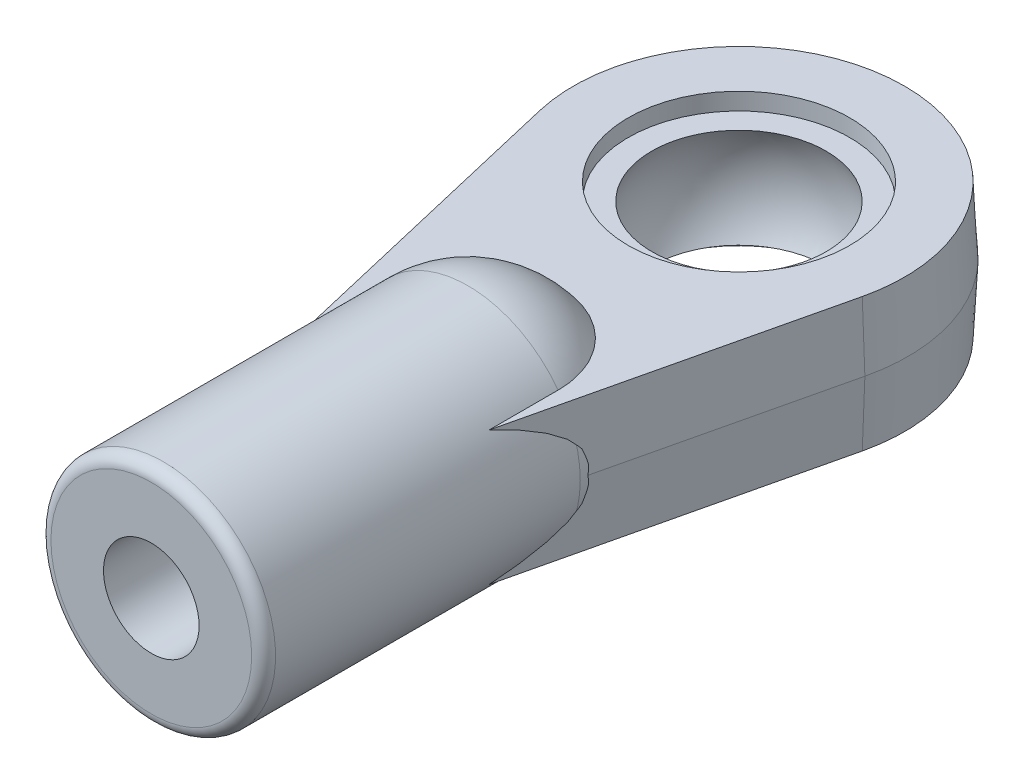
ISO-10303-21;
HEADER;
FILE_DESCRIPTION(('STEP AP214'),'2;1');
FILE_NAME('part.step','',(''),(''),'','','');
FILE_SCHEMA(('AUTOMOTIVE_DESIGN { 1 0 10303 214 1 1 1 1 }'));
ENDSEC;
DATA;
#1=APPLICATION_CONTEXT('core data for automotive mechanical design processes');
#2=APPLICATION_PROTOCOL_DEFINITION('international standard','automotive_design',2000,#1);
#3=PRODUCT_CONTEXT('',#1,'mechanical');
#4=PRODUCT('Part','Part','',(#3));
#5=PRODUCT_RELATED_PRODUCT_CATEGORY('part','',(#4));
#6=PRODUCT_DEFINITION_FORMATION('','',#4);
#7=PRODUCT_DEFINITION_CONTEXT('part definition',#1,'design');
#8=PRODUCT_DEFINITION('design','',#6,#7);
#9=PRODUCT_DEFINITION_SHAPE('','',#8);
#10=(LENGTH_UNIT() NAMED_UNIT(*) SI_UNIT(.MILLI.,.METRE.));
#11=(NAMED_UNIT(*) PLANE_ANGLE_UNIT() SI_UNIT($,.RADIAN.));
#12=(NAMED_UNIT(*) SI_UNIT($,.STERADIAN.) SOLID_ANGLE_UNIT());
#13=UNCERTAINTY_MEASURE_WITH_UNIT(LENGTH_MEASURE(1.E-05),#10,'distance_accuracy_value','');
#14=(GEOMETRIC_REPRESENTATION_CONTEXT(3) GLOBAL_UNCERTAINTY_ASSIGNED_CONTEXT((#13)) GLOBAL_UNIT_ASSIGNED_CONTEXT((#10,
#11,#12)) REPRESENTATION_CONTEXT('',''));
#15=CARTESIAN_POINT('',(0.,0.,0.));
#16=DIRECTION('',(0.,0.,1.));
#17=DIRECTION('',(1.,0.,0.));
#18=AXIS2_PLACEMENT_3D('',#15,#16,#17);
#19=CARTESIAN_POINT('',(0.,1.5875,-18.73885));
#20=DIRECTION('',(0.,1.,0.));
#21=DIRECTION('',(0.,0.,1.));
#22=AXIS2_PLACEMENT_3D('',#19,#20,#21);
#23=PLANE('',#22);
#24=CARTESIAN_POINT('',(0.,1.5875,-18.73885));
#25=DIRECTION('',(0.,1.,0.));
#26=DIRECTION('',(0.,0.,1.));
#27=AXIS2_PLACEMENT_3D('',#24,#25,#26);
#28=CIRCLE('',#27,3.5306);
#29=CARTESIAN_POINT('',(0.,1.5875,-15.20825));
#30=VERTEX_POINT('',#29);
#31=EDGE_CURVE('P0_E20',#30,#30,#28,.T.);
#32=ORIENTED_EDGE('',*,*,#31,.T.);
#33=EDGE_LOOP('',(#32));
#34=FACE_BOUND('',#33,.T.);
#35=CARTESIAN_POINT('',(0.,1.5875,-21.5177713572895));
#36=CARTESIAN_POINT('',(0.0780233970109175,1.5875,-21.5177708897208));
#37=CARTESIAN_POINT('',(0.156061132928654,1.5875,-21.5144824409786));
#38=CARTESIAN_POINT('',(0.311597316268005,1.5875,-21.5013500255618));
#39=CARTESIAN_POINT('',(0.38909559764727,1.5875,-21.4915041234929));
#40=CARTESIAN_POINT('',(0.543117688376616,1.5875,-21.4653010984848));
#41=CARTESIAN_POINT('',(0.61963975090967,1.5875,-21.4489336397251));
#42=CARTESIAN_POINT('',(0.771075578611785,1.5875,-21.4098003250142));
#43=CARTESIAN_POINT('',(0.845987985313132,1.5875,-21.3870292767222));
#44=CARTESIAN_POINT('',(1.06718751098859,1.5875,-21.3094255696959));
#45=CARTESIAN_POINT('',(1.21030919565112,1.5875,-21.2452386063567));
#46=CARTESIAN_POINT('',(1.48372914335094,1.5875,-21.093713605579));
#47=CARTESIAN_POINT('',(1.61402691865729,1.5875,-21.0063746880698));
#48=CARTESIAN_POINT('',(1.7970247350954,1.5875,-20.8599907156731));
#49=CARTESIAN_POINT('',(1.85598367192579,1.5875,-20.808594810804));
#50=CARTESIAN_POINT('',(1.96932163723164,1.5875,-20.7010594238807));
#51=CARTESIAN_POINT('',(2.02370502662113,1.5875,-20.6449245631263));
#52=CARTESIAN_POINT('',(2.12757332441993,1.5875,-20.5282461366586));
#53=CARTESIAN_POINT('',(2.17705600269889,1.5875,-20.4677005853578));
#54=CARTESIAN_POINT('',(2.27074994631359,1.5875,-20.3426616964005));
#55=CARTESIAN_POINT('',(2.31495998807603,1.5875,-20.2781674476397));
#56=CARTESIAN_POINT('',(2.43915822774601,1.5875,-20.0794648960385));
#57=CARTESIAN_POINT('',(2.51082410606128,1.5875,-19.9399134812632));
#58=CARTESIAN_POINT('',(2.62966634363635,1.5875,-19.6508349270353));
#59=CARTESIAN_POINT('',(2.67684296445287,1.5875,-19.5013078941462));
#60=CARTESIAN_POINT('',(2.74543580972441,1.5875,-19.1964365865845));
#61=CARTESIAN_POINT('',(2.76685189660724,1.5875,-19.0410922808496));
#62=CARTESIAN_POINT('',(2.78329356222039,1.5875,-18.7290133036645));
#63=CARTESIAN_POINT('',(2.77831914095071,1.5875,-18.5722786322141));
#64=CARTESIAN_POINT('',(2.74214097095968,1.5875,-18.2618875359936));
#65=CARTESIAN_POINT('',(2.71093736231285,1.5875,-18.108231094789));
#66=CARTESIAN_POINT('',(2.62312852141531,1.5875,-17.8082652710581));
#67=CARTESIAN_POINT('',(2.56652301785846,1.5875,-17.6619559670218));
#68=CARTESIAN_POINT('',(2.46389138915448,1.5875,-17.4513030402927));
#69=CARTESIAN_POINT('',(2.42670294999351,1.5875,-17.3825203687204));
#70=CARTESIAN_POINT('',(2.34666639430291,1.5875,-17.2483286082619));
#71=CARTESIAN_POINT('',(2.30381959030906,1.5875,-17.1829187418847));
#72=CARTESIAN_POINT('',(2.21278651269454,1.5875,-17.0559720709137));
#73=CARTESIAN_POINT('',(2.16460266549794,1.5875,-16.9944335260597));
#74=CARTESIAN_POINT('',(2.06319162073477,1.5875,-16.8755842356939));
#75=CARTESIAN_POINT('',(2.00995960080364,1.5875,-16.8182776276671));
#76=CARTESIAN_POINT('',(1.84335642684013,1.5875,-16.653475168277));
#77=CARTESIAN_POINT('',(1.72295727630919,1.58750000000001,-16.5529284561832));
#78=CARTESIAN_POINT('',(1.46697274328732,1.58749999999999,-16.3735121455689));
#79=CARTESIAN_POINT('',(1.33138793830244,1.58749999999997,-16.2946417230992));
#80=CARTESIAN_POINT('',(1.11956731470582,1.58749999999998,-16.1942246482444));
#81=CARTESIAN_POINT('',(1.04746232878977,1.5875,-16.163708090048));
#82=CARTESIAN_POINT('',(0.900976845737199,1.58750000000001,-16.1088789966126));
#83=CARTESIAN_POINT('',(0.826598245143451,1.5875,-16.0845614405207));
#84=CARTESIAN_POINT('',(0.676182140780832,1.5875,-16.0423192992328));
#85=CARTESIAN_POINT('',(0.60014746021542,1.5875,-16.0243846189846));
#86=CARTESIAN_POINT('',(0.446852225135867,1.5875,-15.9949816333477));
#87=CARTESIAN_POINT('',(0.369592039110233,1.5875,-15.9835114207263));
#88=CARTESIAN_POINT('',(0.243510088508142,1.5875,-15.9701885983606));
#89=CARTESIAN_POINT('',(0.194890190052977,1.5875,-15.9663423325502));
#90=CARTESIAN_POINT('',(0.0975153944611177,1.5875,-15.9612122086222));
#91=CARTESIAN_POINT('',(0.0487604973244243,1.5875,-15.9599283505047));
#92=CARTESIAN_POINT('',(-0.0780233970109172,1.5875,-15.9599291102792));
#93=CARTESIAN_POINT('',(-0.156061132928654,1.5875,-15.9632175590214));
#94=CARTESIAN_POINT('',(-0.311597316268005,1.5875,-15.9763499744382));
#95=CARTESIAN_POINT('',(-0.38909559764727,1.5875,-15.9861958765071));
#96=CARTESIAN_POINT('',(-0.543117688376615,1.5875,-16.0123989015152));
#97=CARTESIAN_POINT('',(-0.619639750909669,1.5875,-16.0287663602749));
#98=CARTESIAN_POINT('',(-0.771075578611784,1.5875,-16.0678996749858));
#99=CARTESIAN_POINT('',(-0.845987985313132,1.5875,-16.0906707232778));
#100=CARTESIAN_POINT('',(-1.06718751098859,1.5875,-16.1682744303041));
#101=CARTESIAN_POINT('',(-1.21030919565111,1.5875,-16.2324613936433));
#102=CARTESIAN_POINT('',(-1.48372914335094,1.5875,-16.383986394421));
#103=CARTESIAN_POINT('',(-1.61402691865729,1.5875,-16.4713253119302));
#104=CARTESIAN_POINT('',(-1.7970247350954,1.5875,-16.6177092843269));
#105=CARTESIAN_POINT('',(-1.85598367192579,1.5875,-16.669105189196));
#106=CARTESIAN_POINT('',(-1.96932163723163,1.5875,-16.7766405761193));
#107=CARTESIAN_POINT('',(-2.02370502662112,1.5875,-16.8327754368737));
#108=CARTESIAN_POINT('',(-2.12757332441993,1.5875,-16.9494538633414));
#109=CARTESIAN_POINT('',(-2.17705600269889,1.5875,-17.0099994146421));
#110=CARTESIAN_POINT('',(-2.27074994631359,1.5875,-17.1350383035995));
#111=CARTESIAN_POINT('',(-2.31495998807602,1.5875,-17.1995325523603));
#112=CARTESIAN_POINT('',(-2.43915822774601,1.5875,-17.3982351039615));
#113=CARTESIAN_POINT('',(-2.51082410606128,1.5875,-17.5377865187368));
#114=CARTESIAN_POINT('',(-2.62966634363635,1.5875,-17.8268650729647));
#115=CARTESIAN_POINT('',(-2.67684296445287,1.5875,-17.9763921058538));
#116=CARTESIAN_POINT('',(-2.74543580972441,1.5875,-18.2812634134155));
#117=CARTESIAN_POINT('',(-2.76685189660724,1.5875,-18.4366077191504));
#118=CARTESIAN_POINT('',(-2.78329356222039,1.5875,-18.7486866963355));
#119=CARTESIAN_POINT('',(-2.77831914095071,1.5875,-18.9054213677859));
#120=CARTESIAN_POINT('',(-2.74214097095968,1.5875,-19.2158124640064));
#121=CARTESIAN_POINT('',(-2.71093736231285,1.5875,-19.369468905211));
#122=CARTESIAN_POINT('',(-2.62312852141531,1.5875,-19.6694347289419));
#123=CARTESIAN_POINT('',(-2.56652301785846,1.5875,-19.8157440329782));
#124=CARTESIAN_POINT('',(-2.46389138915447,1.5875,-20.0263969597073));
#125=CARTESIAN_POINT('',(-2.42670294999351,1.5875,-20.0951796312795));
#126=CARTESIAN_POINT('',(-2.34666639430291,1.5875,-20.2293713917381));
#127=CARTESIAN_POINT('',(-2.30381959030906,1.5875,-20.2947812581153));
#128=CARTESIAN_POINT('',(-2.21278651269455,1.5875,-20.4217279290863));
#129=CARTESIAN_POINT('',(-2.16460266549794,1.5875,-20.4832664739403));
#130=CARTESIAN_POINT('',(-2.06319162073478,1.5875,-20.6021157643061));
#131=CARTESIAN_POINT('',(-2.00995960080364,1.5875,-20.6594223723328));
#132=CARTESIAN_POINT('',(-1.84335642684014,1.5875,-20.824224831723));
#133=CARTESIAN_POINT('',(-1.7229572763092,1.58750000000001,-20.9247715438168));
#134=CARTESIAN_POINT('',(-1.46697274328732,1.58749999999999,-21.1041878544311));
#135=CARTESIAN_POINT('',(-1.33138793830245,1.58749999999996,-21.1830582769008));
#136=CARTESIAN_POINT('',(-1.11956731470582,1.58749999999998,-21.2834753517556));
#137=CARTESIAN_POINT('',(-1.04746232878977,1.58749999999999,-21.313991909952));
#138=CARTESIAN_POINT('',(-0.900976845737205,1.58750000000001,-21.3688210033874));
#139=CARTESIAN_POINT('',(-0.826598245143456,1.5875,-21.3931385594793));
#140=CARTESIAN_POINT('',(-0.676182140780837,1.5875,-21.4353807007672));
#141=CARTESIAN_POINT('',(-0.600147460215425,1.5875,-21.4533153810154));
#142=CARTESIAN_POINT('',(-0.446852225135871,1.5875,-21.4827183666523));
#143=CARTESIAN_POINT('',(-0.369592039110237,1.5875,-21.4941885792737));
#144=CARTESIAN_POINT('',(-0.243510088508145,1.5875,-21.5075114016394));
#145=CARTESIAN_POINT('',(-0.194890190052979,1.5875,-21.5113576674498));
#146=CARTESIAN_POINT('',(-0.0975153944611187,1.5875,-21.5164877913778));
#147=CARTESIAN_POINT('',(-0.0487604973244245,1.5875,-21.5177716494953));
#148=CARTESIAN_POINT('',(0.,1.5875,-21.5177713572895));
#149=B_SPLINE_CURVE_WITH_KNOTS('',3,(#35,#36,#37,#38,#39,#40,#41,#42,#43,#44,#45,#46,#47,#48,
#49,#50,#51,#52,#53,#54,#55,#56,#57,#58,#59,#60,#61,#62,#63,#64,#65,#66,#67,#68,#69,#70,#71,#72,
#73,#74,#75,#76,#77,#78,#79,#80,#81,#82,#83,#84,#85,#86,#87,#88,#89,#90,#91,#92,#93,#94,#95,#96,
#97,#98,#99,#100,#101,#102,#103,#104,#105,#106,#107,#108,#109,#110,#111,#112,#113,#114,#115,
#116,#117,#118,#119,#120,#121,#122,#123,#124,#125,#126,#127,#128,#129,#130,#131,#132,#133,#134,
#135,#136,#137,#138,#139,#140,#141,#142,#143,#144,#145,#146,#147,#148),.UNSPECIFIED.,.T.,.F.,(4,
2,2,2,2,2,2,2,2,2,2,2,2,2,2,2,2,2,2,2,2,2,2,2,2,2,2,2,2,2,2,2,2,2,2,2,2,2,2,2,2,2,2,2,2,2,2,2,2,
2,2,2,2,2,2,2,4),(0.,0.234025302373472,0.46811970658274,0.702586605236248,0.93724417192487,
1.40544072040476,1.87365506889924,2.10806901100275,2.34225694275971,2.57655095968591,
2.81089924175706,3.27910719063613,3.74731013873254,4.21551558722033,4.68372103570813,
5.15192398380455,5.62013193268361,5.85448021475476,6.08877423168096,6.32296216343792,
6.55737610554143,7.02559045403588,7.49378700251573,7.72844456920437,7.9629114678579,
8.19700587206719,8.43103117444068,8.57728461337557,8.72353805231047,8.95756335468394,
9.19165775889321,9.42612465754672,9.66078222423534,10.1289787727152,10.5971931212097,
10.8316070633132,11.0657949950702,11.3000890119964,11.5344372940675,12.0026452429466,
12.470848191043,12.9390536395308,13.4072590880186,13.875462036115,14.3436699849941,
14.5780182670652,14.8123122839914,15.0465002157484,15.2809141578519,15.7491285063463,
16.2173250548262,16.4519826215148,16.6864495201684,16.9205439243777,17.1545692267511,
17.300822665686,17.4470761046209),.UNSPECIFIED.);
#150=CARTESIAN_POINT('',(0.,1.5875,-21.5177713572895));
#151=VERTEX_POINT('',#150);
#152=EDGE_CURVE('P0_E243',#151,#151,#149,.T.);
#153=ORIENTED_EDGE('',*,*,#152,.T.);
#154=EDGE_LOOP('',(#153));
#155=FACE_BOUND('',#154,.T.);
#156=ADVANCED_FACE('P0_F16',(#34,#155),#23,.T.);
#157=CARTESIAN_POINT('',(0.,1.5875,-18.73885));
#158=DIRECTION('',(0.,1.,0.));
#159=DIRECTION('',(0.,0.,1.));
#160=AXIS2_PLACEMENT_3D('',#157,#158,#159);
#161=CYLINDRICAL_SURFACE('',#160,3.5306);
#162=CARTESIAN_POINT('',(0.,2.1336,-18.73885));
#163=DIRECTION('',(0.,1.,0.));
#164=DIRECTION('',(0.,0.,1.));
#165=AXIS2_PLACEMENT_3D('',#162,#163,#164);
#166=CIRCLE('',#165,3.5306);
#167=CARTESIAN_POINT('',(0.,2.1336,-15.20825));
#168=VERTEX_POINT('',#167);
#169=EDGE_CURVE('P0_E238',#168,#168,#166,.F.);
#170=ORIENTED_EDGE('',*,*,#169,.F.);
#171=EDGE_LOOP('',(#170));
#172=FACE_BOUND('',#171,.T.);
#173=ORIENTED_EDGE('',*,*,#31,.F.);
#174=EDGE_LOOP('',(#173));
#175=FACE_BOUND('',#174,.T.);
#176=ADVANCED_FACE('P0_F76',(#172,#175),#161,.F.);
#177=CARTESIAN_POINT('',(0.,0.,-12.0142000001238));
#178=DIRECTION('',(0.,0.,1.));
#179=DIRECTION('',(1.,0.,0.));
#180=AXIS2_PLACEMENT_3D('',#177,#178,#179);
#181=CONICAL_SURFACE('',#180,1.52399999979025,1.02974425846679);
#182=CARTESIAN_POINT('',(-2.55795384873636E-10,0.,-12.9299115835408));
#183=VERTEX_POINT('',#182);
#184=VERTEX_LOOP('',#183);
#185=FACE_BOUND('',#184,.T.);
#186=CARTESIAN_POINT('',(0.,0.,-12.0142));
#187=DIRECTION('',(0.,0.,1.));
#188=DIRECTION('',(1.,0.,0.));
#189=AXIS2_PLACEMENT_3D('',#186,#187,#188);
#190=CIRCLE('',#189,1.524);
#191=CARTESIAN_POINT('',(1.524,0.,-12.0142));
#192=VERTEX_POINT('',#191);
#193=EDGE_CURVE('P0_E80',#192,#192,#190,.T.);
#194=ORIENTED_EDGE('',*,*,#193,.T.);
#195=EDGE_LOOP('',(#194));
#196=FACE_BOUND('',#195,.T.);
#197=ADVANCED_FACE('P0_F72',(#185,#196),#181,.F.);
#198=CARTESIAN_POINT('',(-2.62620354632618,0.,-6.35));
#199=DIRECTION('',(0.,0.0523359562429439,0.998629534754574));
#200=DIRECTION('',(0.,-0.998629534754574,0.0523359562429439));
#201=AXIS2_PLACEMENT_3D('',#198,#199,#200);
#202=PLANE('',#201);
#203=DIRECTION('',(1.,0.,0.));
#204=VECTOR('',#203,1.);
#205=CARTESIAN_POINT('',(0.,2.1336,-6.4618172378783));
#206=LINE('',#205,#204);
#207=CARTESIAN_POINT('',(-2.53762061529938,2.1336,-6.4618172378783));
#208=VERTEX_POINT('',#207);
#209=CARTESIAN_POINT('',(2.53762061529963,2.1336,-6.4618172378783));
#210=VERTEX_POINT('',#209);
#211=EDGE_CURVE('P0_E229',#208,#210,#206,.T.);
#212=ORIENTED_EDGE('',*,*,#211,.F.);
#213=DIRECTION('',(0.0414255695402248,0.997772303834552,-0.0522910306740929));
#214=VECTOR('',#213,1.);
#215=CARTESIAN_POINT('',(-2.62620354632618,0.,-6.35));
#216=LINE('',#215,#214);
#217=CARTESIAN_POINT('',(-2.62620354632618,0.,-6.35));
#218=VERTEX_POINT('',#217);
#219=EDGE_CURVE('P0_E88',#218,#208,#216,.T.);
#220=ORIENTED_EDGE('',*,*,#219,.F.);
#221=DIRECTION('',(1.,0.,0.));
#222=VECTOR('',#221,1.);
#223=CARTESIAN_POINT('',(-2.62620354632618,0.,-6.35));
#224=LINE('',#223,#222);
#225=CARTESIAN_POINT('',(-1.524,0.,-6.35));
#226=VERTEX_POINT('',#225);
#227=EDGE_CURVE('P0_E68',#218,#226,#224,.T.);
#228=ORIENTED_EDGE('',*,*,#227,.T.);
#229=CARTESIAN_POINT('',(0.,0.,-6.35));
#230=DIRECTION('',(0.,0.0523359562429439,0.998629534754574));
#231=DIRECTION('',(0.,-0.998629534754574,0.0523359562429439));
#232=AXIS2_PLACEMENT_3D('',#229,#230,#231);
#233=ELLIPSE('',#232,1.52609145530083,1.524);
#234=CARTESIAN_POINT('',(1.524,0.,-6.35));
#235=VERTEX_POINT('',#234);
#236=EDGE_CURVE('P0_E239',#226,#235,#233,.F.);
#237=ORIENTED_EDGE('',*,*,#236,.T.);
#238=DIRECTION('',(1.,0.,0.));
#239=VECTOR('',#238,1.);
#240=CARTESIAN_POINT('',(-2.62620354632618,0.,-6.35));
#241=LINE('',#240,#239);
#242=CARTESIAN_POINT('',(2.62620354632643,0.,-6.35));
#243=VERTEX_POINT('',#242);
#244=EDGE_CURVE('P0_E180',#235,#243,#241,.T.);
#245=ORIENTED_EDGE('',*,*,#244,.T.);
#246=DIRECTION('',(0.0414255695402248,-0.997772303834552,0.0522910306740929));
#247=VECTOR('',#246,1.);
#248=CARTESIAN_POINT('',(2.53762061529963,2.1336,-6.4618172378783));
#249=LINE('',#248,#247);
#250=EDGE_CURVE('P0_E86',#210,#243,#249,.T.);
#251=ORIENTED_EDGE('',*,*,#250,.F.);
#252=EDGE_LOOP('',(#212,#220,#228,#237,#245,#251));
#253=FACE_BOUND('',#252,.T.);
#254=ADVANCED_FACE('P0_F75',(#253),#202,.T.);
#255=CARTESIAN_POINT('',(0.,2.1336,-18.73885));
#256=DIRECTION('',(0.,1.,0.));
#257=DIRECTION('',(0.,0.,1.));
#258=AXIS2_PLACEMENT_3D('',#255,#256,#257);
#259=PLANE('',#258);
#260=ORIENTED_EDGE('',*,*,#211,.T.);
#261=DIRECTION('',(0.228803541615055,0.,-0.973472618692692));
#262=VECTOR('',#261,1.);
#263=CARTESIAN_POINT('',(5.13928588889286,2.13360000000001,-17.5309199666622));
#264=LINE('',#263,#262);
#265=CARTESIAN_POINT('',(5.139285888895,2.13360000001282,-17.5309199666613));
#266=VERTEX_POINT('',#265);
#267=EDGE_CURVE('P0_E82',#266,#210,#264,.F.);
#268=ORIENTED_EDGE('',*,*,#267,.F.);
#269=CARTESIAN_POINT('',(0.,2.1335999999792,-18.73885));
#270=DIRECTION('',(0.,-1.,0.));
#271=DIRECTION('',(0.,0.,-1.));
#272=AXIS2_PLACEMENT_3D('',#269,#270,#271);
#273=CIRCLE('',#272,5.27933276212576);
#274=CARTESIAN_POINT('',(-5.1392858888958,2.13360000001282,-17.5309199666612));
#275=VERTEX_POINT('',#274);
#276=EDGE_CURVE('P0_E113',#275,#266,#273,.T.);
#277=ORIENTED_EDGE('',*,*,#276,.F.);
#278=DIRECTION('',(0.228803541615055,0.,0.973472618692692));
#279=VECTOR('',#278,1.);
#280=CARTESIAN_POINT('',(-3.47254898062763,2.1336,-10.4395841800412));
#281=LINE('',#280,#279);
#282=EDGE_CURVE('P0_E83',#208,#275,#281,.F.);
#283=ORIENTED_EDGE('',*,*,#282,.F.);
#284=EDGE_LOOP('',(#260,#268,#277,#283));
#285=FACE_BOUND('',#284,.T.);
#286=ORIENTED_EDGE('',*,*,#169,.T.);
#287=EDGE_LOOP('',(#286));
#288=FACE_BOUND('',#287,.T.);
#289=ADVANCED_FACE('P0_F146',(#285,#288),#259,.T.);
#290=CARTESIAN_POINT('',(0.,0.,-18.73885));
#291=DIRECTION('',(-1.,0.,0.));
#292=DIRECTION('',(0.,0.,1.));
#293=AXIS2_PLACEMENT_3D('',#290,#291,#292);
#294=SPHERICAL_SURFACE('',#293,3.2004);
#295=CARTESIAN_POINT('',(3.2004,0.,-18.73885));
#296=VERTEX_POINT('',#295);
#297=VERTEX_LOOP('',#296);
#298=FACE_BOUND('',#297,.T.);
#299=CARTESIAN_POINT('',(-3.2004,0.,-18.73885));
#300=VERTEX_POINT('',#299);
#301=VERTEX_LOOP('',#300);
#302=FACE_BOUND('',#301,.T.);
#303=CARTESIAN_POINT('',(0.,-1.5875,-21.5177713572895));
#304=CARTESIAN_POINT('',(-0.0780233970109173,-1.5875,-21.5177708897208));
#305=CARTESIAN_POINT('',(-0.156061132928654,-1.5875,-21.5144824409786));
#306=CARTESIAN_POINT('',(-0.311597316268005,-1.5875,-21.5013500255618));
#307=CARTESIAN_POINT('',(-0.38909559764727,-1.5875,-21.4915041234929));
#308=CARTESIAN_POINT('',(-0.543117688376615,-1.5875,-21.4653010984848));
#309=CARTESIAN_POINT('',(-0.619639750909669,-1.5875,-21.4489336397251));
#310=CARTESIAN_POINT('',(-0.771075578611784,-1.5875,-21.4098003250142));
#311=CARTESIAN_POINT('',(-0.845987985313132,-1.5875,-21.3870292767222));
#312=CARTESIAN_POINT('',(-1.06718751098859,-1.5875,-21.3094255696959));
#313=CARTESIAN_POINT('',(-1.21030919565111,-1.5875,-21.2452386063567));
#314=CARTESIAN_POINT('',(-1.48372914335094,-1.5875,-21.093713605579));
#315=CARTESIAN_POINT('',(-1.61402691865729,-1.5875,-21.0063746880698));
#316=CARTESIAN_POINT('',(-1.7970247350954,-1.5875,-20.8599907156731));
#317=CARTESIAN_POINT('',(-1.85598367192579,-1.5875,-20.808594810804));
#318=CARTESIAN_POINT('',(-1.96932163723163,-1.5875,-20.7010594238807));
#319=CARTESIAN_POINT('',(-2.02370502662112,-1.5875,-20.6449245631263));
#320=CARTESIAN_POINT('',(-2.12757332441993,-1.5875,-20.5282461366586));
#321=CARTESIAN_POINT('',(-2.17705600269889,-1.5875,-20.4677005853578));
#322=CARTESIAN_POINT('',(-2.27074994631359,-1.5875,-20.3426616964005));
#323=CARTESIAN_POINT('',(-2.31495998807602,-1.5875,-20.2781674476397));
#324=CARTESIAN_POINT('',(-2.43915822774601,-1.5875,-20.0794648960385));
#325=CARTESIAN_POINT('',(-2.51082410606128,-1.5875,-19.9399134812632));
#326=CARTESIAN_POINT('',(-2.62966634363635,-1.5875,-19.6508349270353));
#327=CARTESIAN_POINT('',(-2.67684296445287,-1.5875,-19.5013078941462));
#328=CARTESIAN_POINT('',(-2.74543580972441,-1.5875,-19.1964365865845));
#329=CARTESIAN_POINT('',(-2.76685189660724,-1.5875,-19.0410922808496));
#330=CARTESIAN_POINT('',(-2.78329356222039,-1.5875,-18.7290133036644));
#331=CARTESIAN_POINT('',(-2.77831914095071,-1.5875,-18.5722786322141));
#332=CARTESIAN_POINT('',(-2.74214097095968,-1.5875,-18.2618875359936));
#333=CARTESIAN_POINT('',(-2.71093736231285,-1.5875,-18.108231094789));
#334=CARTESIAN_POINT('',(-2.62312852141531,-1.5875,-17.808265271058));
#335=CARTESIAN_POINT('',(-2.56652301785846,-1.5875,-17.6619559670218));
#336=CARTESIAN_POINT('',(-2.46389138915448,-1.5875,-17.4513030402927));
#337=CARTESIAN_POINT('',(-2.42670294999351,-1.5875,-17.3825203687204));
#338=CARTESIAN_POINT('',(-2.34666639430291,-1.5875,-17.2483286082619));
#339=CARTESIAN_POINT('',(-2.30381959030906,-1.5875,-17.1829187418847));
#340=CARTESIAN_POINT('',(-2.21278651269455,-1.5875,-17.0559720709137));
#341=CARTESIAN_POINT('',(-2.16460266549794,-1.5875,-16.9944335260597));
#342=CARTESIAN_POINT('',(-2.06319162073478,-1.5875,-16.8755842356939));
#343=CARTESIAN_POINT('',(-2.00995960080364,-1.5875,-16.8182776276671));
#344=CARTESIAN_POINT('',(-1.84335642684013,-1.5875,-16.653475168277));
#345=CARTESIAN_POINT('',(-1.7229572763092,-1.58750000000001,-16.5529284561832));
#346=CARTESIAN_POINT('',(-1.46697274328732,-1.58749999999999,-16.3735121455689));
#347=CARTESIAN_POINT('',(-1.33138793830244,-1.58749999999997,-16.2946417230992));
#348=CARTESIAN_POINT('',(-1.11956731470582,-1.58749999999998,-16.1942246482444));
#349=CARTESIAN_POINT('',(-1.04746232878977,-1.5875,-16.163708090048));
#350=CARTESIAN_POINT('',(-0.900976845737201,-1.58750000000001,-16.1088789966126));
#351=CARTESIAN_POINT('',(-0.826598245143452,-1.5875,-16.0845614405207));
#352=CARTESIAN_POINT('',(-0.676182140780833,-1.5875,-16.0423192992328));
#353=CARTESIAN_POINT('',(-0.600147460215421,-1.5875,-16.0243846189846));
#354=CARTESIAN_POINT('',(-0.446852225135867,-1.5875,-15.9949816333477));
#355=CARTESIAN_POINT('',(-0.369592039110233,-1.5875,-15.9835114207263));
#356=CARTESIAN_POINT('',(-0.243510088508142,-1.5875,-15.9701885983606));
#357=CARTESIAN_POINT('',(-0.194890190052977,-1.5875,-15.9663423325502));
#358=CARTESIAN_POINT('',(-0.0975153944611174,-1.5875,-15.9612122086222));
#359=CARTESIAN_POINT('',(-0.0487604973244239,-1.5875,-15.9599283505047));
#360=CARTESIAN_POINT('',(0.0780233970109176,-1.5875,-15.9599291102792));
#361=CARTESIAN_POINT('',(0.156061132928654,-1.5875,-15.9632175590214));
#362=CARTESIAN_POINT('',(0.311597316268005,-1.5875,-15.9763499744382));
#363=CARTESIAN_POINT('',(0.38909559764727,-1.5875,-15.9861958765071));
#364=CARTESIAN_POINT('',(0.543117688376616,-1.5875,-16.0123989015152));
#365=CARTESIAN_POINT('',(0.61963975090967,-1.5875,-16.0287663602749));
#366=CARTESIAN_POINT('',(0.771075578611785,-1.5875,-16.0678996749858));
#367=CARTESIAN_POINT('',(0.845987985313132,-1.5875,-16.0906707232778));
#368=CARTESIAN_POINT('',(1.06718751098859,-1.5875,-16.1682744303041));
#369=CARTESIAN_POINT('',(1.21030919565112,-1.5875,-16.2324613936433));
#370=CARTESIAN_POINT('',(1.48372914335094,-1.5875,-16.383986394421));
#371=CARTESIAN_POINT('',(1.61402691865729,-1.5875,-16.4713253119302));
#372=CARTESIAN_POINT('',(1.7970247350954,-1.5875,-16.6177092843269));
#373=CARTESIAN_POINT('',(1.85598367192579,-1.5875,-16.669105189196));
#374=CARTESIAN_POINT('',(1.96932163723163,-1.5875,-16.7766405761193));
#375=CARTESIAN_POINT('',(2.02370502662112,-1.5875,-16.8327754368737));
#376=CARTESIAN_POINT('',(2.12757332441993,-1.5875,-16.9494538633414));
#377=CARTESIAN_POINT('',(2.17705600269889,-1.5875,-17.0099994146421));
#378=CARTESIAN_POINT('',(2.27074994631359,-1.5875,-17.1350383035995));
#379=CARTESIAN_POINT('',(2.31495998807602,-1.5875,-17.1995325523603));
#380=CARTESIAN_POINT('',(2.43915822774601,-1.5875,-17.3982351039615));
#381=CARTESIAN_POINT('',(2.51082410606128,-1.5875,-17.5377865187368));
#382=CARTESIAN_POINT('',(2.62966634363635,-1.5875,-17.8268650729647));
#383=CARTESIAN_POINT('',(2.67684296445287,-1.5875,-17.9763921058538));
#384=CARTESIAN_POINT('',(2.74543580972441,-1.5875,-18.2812634134155));
#385=CARTESIAN_POINT('',(2.76685189660724,-1.5875,-18.4366077191504));
#386=CARTESIAN_POINT('',(2.78329356222039,-1.5875,-18.7486866963356));
#387=CARTESIAN_POINT('',(2.77831914095071,-1.5875,-18.9054213677859));
#388=CARTESIAN_POINT('',(2.74214097095968,-1.5875,-19.2158124640064));
#389=CARTESIAN_POINT('',(2.71093736231285,-1.5875,-19.369468905211));
#390=CARTESIAN_POINT('',(2.62312852141531,-1.5875,-19.6694347289419));
#391=CARTESIAN_POINT('',(2.56652301785846,-1.5875,-19.8157440329782));
#392=CARTESIAN_POINT('',(2.46389138915448,-1.5875,-20.0263969597073));
#393=CARTESIAN_POINT('',(2.42670294999351,-1.5875,-20.0951796312795));
#394=CARTESIAN_POINT('',(2.34666639430291,-1.5875,-20.2293713917381));
#395=CARTESIAN_POINT('',(2.30381959030906,-1.5875,-20.2947812581153));
#396=CARTESIAN_POINT('',(2.21278651269455,-1.5875,-20.4217279290863));
#397=CARTESIAN_POINT('',(2.16460266549794,-1.5875,-20.4832664739403));
#398=CARTESIAN_POINT('',(2.06319162073477,-1.5875,-20.6021157643061));
#399=CARTESIAN_POINT('',(2.00995960080364,-1.5875,-20.6594223723329));
#400=CARTESIAN_POINT('',(1.84335642684013,-1.5875,-20.824224831723));
#401=CARTESIAN_POINT('',(1.7229572763092,-1.58750000000001,-20.9247715438168));
#402=CARTESIAN_POINT('',(1.46697274328732,-1.58749999999999,-21.1041878544311));
#403=CARTESIAN_POINT('',(1.33138793830244,-1.58749999999997,-21.1830582769008));
#404=CARTESIAN_POINT('',(1.11956731470582,-1.58749999999998,-21.2834753517556));
#405=CARTESIAN_POINT('',(1.04746232878977,-1.5875,-21.313991909952));
#406=CARTESIAN_POINT('',(0.900976845737201,-1.58750000000001,-21.3688210033874));
#407=CARTESIAN_POINT('',(0.826598245143454,-1.5875,-21.3931385594793));
#408=CARTESIAN_POINT('',(0.676182140780835,-1.5875,-21.4353807007672));
#409=CARTESIAN_POINT('',(0.600147460215423,-1.5875,-21.4533153810154));
#410=CARTESIAN_POINT('',(0.446852225135868,-1.5875,-21.4827183666523));
#411=CARTESIAN_POINT('',(0.369592039110234,-1.5875,-21.4941885792737));
#412=CARTESIAN_POINT('',(0.243510088508143,-1.5875,-21.5075114016394));
#413=CARTESIAN_POINT('',(0.194890190052978,-1.5875,-21.5113576674498));
#414=CARTESIAN_POINT('',(0.0975153944611182,-1.5875,-21.5164877913778));
#415=CARTESIAN_POINT('',(0.0487604973244245,-1.5875,-21.5177716494953));
#416=CARTESIAN_POINT('',(0.,-1.5875,-21.5177713572895));
#417=B_SPLINE_CURVE_WITH_KNOTS('',3,(#303,#304,#305,#306,#307,#308,#309,#310,#311,#312,#313,
#314,#315,#316,#317,#318,#319,#320,#321,#322,#323,#324,#325,#326,#327,#328,#329,#330,#331,#332,
#333,#334,#335,#336,#337,#338,#339,#340,#341,#342,#343,#344,#345,#346,#347,#348,#349,#350,#351,
#352,#353,#354,#355,#356,#357,#358,#359,#360,#361,#362,#363,#364,#365,#366,#367,#368,#369,#370,
#371,#372,#373,#374,#375,#376,#377,#378,#379,#380,#381,#382,#383,#384,#385,#386,#387,#388,#389,
#390,#391,#392,#393,#394,#395,#396,#397,#398,#399,#400,#401,#402,#403,#404,#405,#406,#407,#408,
#409,#410,#411,#412,#413,#414,#415,#416),.UNSPECIFIED.,.T.,.F.,(4,2,2,2,2,2,2,2,2,2,2,2,2,2,2,2,
2,2,2,2,2,2,2,2,2,2,2,2,2,2,2,2,2,2,2,2,2,2,2,2,2,2,2,2,2,2,2,2,2,2,2,2,2,2,2,2,4),(0.,
0.234025302373472,0.468119706582741,0.702586605236248,0.937244171924871,1.40544072040476,
1.87365506889924,2.10806901100275,2.34225694275971,2.57655095968591,2.81089924175706,
3.27910719063612,3.74731013873255,4.21551558722034,4.68372103570813,5.15192398380455,
5.62013193268361,5.85448021475476,6.08877423168096,6.32296216343792,6.55737610554143,
7.02559045403588,7.49378700251574,7.72844456920438,7.9629114678579,8.19700587206719,
8.43103117444068,8.57728461337557,8.72353805231047,8.95756335468394,9.19165775889321,
9.42612465754672,9.66078222423534,10.1289787727152,10.5971931212097,10.8316070633132,
11.0657949950702,11.3000890119964,11.5344372940675,12.0026452429466,12.470848191043,
12.9390536395308,13.4072590880186,13.875462036115,14.3436699849941,14.5780182670652,
14.8123122839914,15.0465002157484,15.2809141578519,15.7491285063463,16.2173250548262,
16.4519826215148,16.6864495201684,16.9205439243777,17.1545692267511,17.300822665686,
17.4470761046209),.UNSPECIFIED.);
#418=CARTESIAN_POINT('',(0.,-1.5875,-21.5177713572895));
#419=VERTEX_POINT('',#418);
#420=EDGE_CURVE('P0_E105',#419,#419,#417,.T.);
#421=ORIENTED_EDGE('',*,*,#420,.F.);
#422=EDGE_LOOP('',(#421));
#423=FACE_BOUND('',#422,.T.);
#424=ORIENTED_EDGE('',*,*,#152,.F.);
#425=EDGE_LOOP('',(#424));
#426=FACE_BOUND('',#425,.T.);
#427=ADVANCED_FACE('P0_F115',(#298,#302,#423,#426),#294,.F.);
#428=CARTESIAN_POINT('',(-3.5814,0.,-10.4140000000011));
#429=DIRECTION('',(-0.9721385083014,0.0523359562429439,0.228489974313242));
#430=DIRECTION('',(0.228803541615055,0.,0.973472618692692));
#431=AXIS2_PLACEMENT_3D('',#428,#429,#430);
#432=PLANE('',#431);
#433=ORIENTED_EDGE('',*,*,#282,.T.);
#434=DIRECTION('',(0.0509476203756049,0.998629534754574,-0.0119746521421956));
#435=VECTOR('',#434,1.);
#436=CARTESIAN_POINT('',(-25462.9996680352,-499000.,5966.04633277495));
#437=LINE('',#436,#435);
#438=CARTESIAN_POINT('',(-5.24813690826712,0.,-17.5053357866217));
#439=VERTEX_POINT('',#438);
#440=EDGE_CURVE('P0_E214',#439,#275,#437,.T.);
#441=ORIENTED_EDGE('',*,*,#440,.F.);
#442=DIRECTION('',(0.228803541615055,0.,0.973472618692692));
#443=VECTOR('',#442,1.);
#444=CARTESIAN_POINT('',(-3.5814,0.,-10.4140000000011));
#445=LINE('',#444,#443);
#446=EDGE_CURVE('P0_E104',#218,#439,#445,.F.);
#447=ORIENTED_EDGE('',*,*,#446,.F.);
#448=ORIENTED_EDGE('',*,*,#219,.T.);
#449=EDGE_LOOP('',(#433,#441,#447,#448));
#450=FACE_BOUND('',#449,.T.);
#451=ADVANCED_FACE('P0_F138',(#450),#432,.T.);
#452=CARTESIAN_POINT('',(0.,0.,0.));
#453=DIRECTION('',(0.,0.,1.));
#454=DIRECTION('',(1.,0.,0.));
#455=AXIS2_PLACEMENT_3D('',#452,#453,#454);
#456=CYLINDRICAL_SURFACE('',#455,1.524);
#457=CARTESIAN_POINT('',(0.,0.,-6.35));
#458=DIRECTION('',(0.,-0.0523359562429439,0.998629534754574));
#459=DIRECTION('',(0.,0.998629534754574,0.0523359562429439));
#460=AXIS2_PLACEMENT_3D('',#457,#458,#459);
#461=ELLIPSE('',#460,1.52609145530083,1.524);
#462=EDGE_CURVE('P0_E101',#235,#226,#461,.F.);
#463=ORIENTED_EDGE('',*,*,#462,.F.);
#464=ORIENTED_EDGE('',*,*,#236,.F.);
#465=EDGE_LOOP('',(#463,#464));
#466=FACE_BOUND('',#465,.T.);
#467=ORIENTED_EDGE('',*,*,#193,.F.);
#468=EDGE_LOOP('',(#467));
#469=FACE_BOUND('',#468,.T.);
#470=ADVANCED_FACE('P0_F135',(#466,#469),#456,.F.);
#471=CARTESIAN_POINT('',(5.24813690826523,0.,-17.5053357866221));
#472=DIRECTION('',(0.9721385083014,0.0523359562429439,0.228489974313241));
#473=DIRECTION('',(0.228803541615055,0.,-0.973472618692692));
#474=AXIS2_PLACEMENT_3D('',#471,#472,#473);
#475=PLANE('',#474);
#476=ORIENTED_EDGE('',*,*,#267,.T.);
#477=ORIENTED_EDGE('',*,*,#250,.T.);
#478=DIRECTION('',(0.228803541615055,0.,-0.973472618692692));
#479=VECTOR('',#478,1.);
#480=CARTESIAN_POINT('',(5.24813690826523,0.,-17.5053357866221));
#481=LINE('',#480,#479);
#482=CARTESIAN_POINT('',(5.24813690826537,0.,-17.5053357866215));
#483=VERTEX_POINT('',#482);
#484=EDGE_CURVE('P0_E190',#483,#243,#481,.F.);
#485=ORIENTED_EDGE('',*,*,#484,.F.);
#486=DIRECTION('',(-0.050947620375605,0.998629534754574,-0.011974652142195));
#487=VECTOR('',#486,1.);
#488=CARTESIAN_POINT('',(25462.9996680353,-499000.,5966.04633277466));
#489=LINE('',#488,#487);
#490=EDGE_CURVE('P0_E112',#266,#483,#489,.F.);
#491=ORIENTED_EDGE('',*,*,#490,.F.);
#492=EDGE_LOOP('',(#476,#477,#485,#491));
#493=FACE_BOUND('',#492,.T.);
#494=ADVANCED_FACE('P0_F131',(#493),#475,.T.);
#495=CARTESIAN_POINT('',(0.,5.6843418860808E-11,-18.73885));
#496=DIRECTION('',(0.,-1.,0.));
#497=DIRECTION('',(0.,0.,-1.));
#498=AXIS2_PLACEMENT_3D('',#495,#496,#497);
#499=CONICAL_SURFACE('',#498,5.39115000000292,0.0523598775611997);
#500=ORIENTED_EDGE('',*,*,#276,.T.);
#501=ORIENTED_EDGE('',*,*,#490,.T.);
#502=CARTESIAN_POINT('',(0.,0.,-18.73885));
#503=DIRECTION('',(0.,1.,0.));
#504=DIRECTION('',(0.,0.,1.));
#505=AXIS2_PLACEMENT_3D('',#502,#503,#504);
#506=CIRCLE('',#505,5.39115000000292);
#507=EDGE_CURVE('P0_E189',#439,#483,#506,.F.);
#508=ORIENTED_EDGE('',*,*,#507,.F.);
#509=ORIENTED_EDGE('',*,*,#440,.T.);
#510=EDGE_LOOP('',(#500,#501,#508,#509));
#511=FACE_BOUND('',#510,.T.);
#512=ADVANCED_FACE('P0_F126',(#511),#499,.T.);
#513=CARTESIAN_POINT('',(0.,-1.5875,-18.73885));
#514=DIRECTION('',(0.,-1.,0.));
#515=DIRECTION('',(0.,0.,-1.));
#516=AXIS2_PLACEMENT_3D('',#513,#514,#515);
#517=PLANE('',#516);
#518=CARTESIAN_POINT('',(0.,-1.5875,-18.73885));
#519=DIRECTION('',(0.,-1.,0.));
#520=DIRECTION('',(0.,0.,-1.));
#521=AXIS2_PLACEMENT_3D('',#518,#519,#520);
#522=CIRCLE('',#521,3.5306);
#523=CARTESIAN_POINT('',(0.,-1.5875,-22.26945));
#524=VERTEX_POINT('',#523);
#525=EDGE_CURVE('P0_E96',#524,#524,#522,.T.);
#526=ORIENTED_EDGE('',*,*,#525,.T.);
#527=EDGE_LOOP('',(#526));
#528=FACE_BOUND('',#527,.T.);
#529=ORIENTED_EDGE('',*,*,#420,.T.);
#530=EDGE_LOOP('',(#529));
#531=FACE_BOUND('',#530,.T.);
#532=ADVANCED_FACE('P0_F120',(#528,#531),#517,.T.);
#533=CARTESIAN_POINT('',(-3.5814,0.,-10.4140000000011));
#534=DIRECTION('',(-0.9721385083014,-0.0523359562429439,0.228489974313242));
#535=DIRECTION('',(0.228803541615055,0.,0.973472618692692));
#536=AXIS2_PLACEMENT_3D('',#533,#534,#535);
#537=PLANE('',#536);
#538=DIRECTION('',(0.228803541615066,0.,0.97347261869269));
#539=VECTOR('',#538,1.);
#540=CARTESIAN_POINT('',(-5.13928588889273,-2.1336,-17.5309199666622));
#541=LINE('',#540,#539);
#542=CARTESIAN_POINT('',(-5.13928588889592,-2.13360000001282,-17.5309199666618));
#543=VERTEX_POINT('',#542);
#544=CARTESIAN_POINT('',(-2.53762061529938,-2.1336,-6.4618172378783));
#545=VERTEX_POINT('',#544);
#546=EDGE_CURVE('P0_E99',#543,#545,#541,.T.);
#547=ORIENTED_EDGE('',*,*,#546,.T.);
#548=DIRECTION('',(0.0414255695402248,-0.997772303834552,-0.0522910306740929));
#549=VECTOR('',#548,1.);
#550=CARTESIAN_POINT('',(-2.62620354632618,0.,-6.35));
#551=LINE('',#550,#549);
#552=EDGE_CURVE('P0_E103',#218,#545,#551,.T.);
#553=ORIENTED_EDGE('',*,*,#552,.F.);
#554=ORIENTED_EDGE('',*,*,#446,.T.);
#555=DIRECTION('',(0.0509476203756049,-0.998629534754574,-0.0119746521421956));
#556=VECTOR('',#555,1.);
#557=CARTESIAN_POINT('',(-25462.9996680352,499000.,5966.04633277493));
#558=LINE('',#557,#556);
#559=EDGE_CURVE('P0_E100',#543,#439,#558,.F.);
#560=ORIENTED_EDGE('',*,*,#559,.F.);
#561=EDGE_LOOP('',(#547,#553,#554,#560));
#562=FACE_BOUND('',#561,.T.);
#563=ADVANCED_FACE('P0_F125',(#562),#537,.T.);
#564=CARTESIAN_POINT('',(-2.62620354632618,0.,-6.35));
#565=DIRECTION('',(0.,-0.0523359562429439,0.998629534754574));
#566=DIRECTION('',(0.,-0.998629534754574,-0.0523359562429439));
#567=AXIS2_PLACEMENT_3D('',#564,#565,#566);
#568=PLANE('',#567);
#569=DIRECTION('',(-0.0414255695402248,-0.997772303834552,-0.0522910306740929));
#570=VECTOR('',#569,1.);
#571=CARTESIAN_POINT('',(2.62620354632643,0.,-6.35));
#572=LINE('',#571,#570);
#573=CARTESIAN_POINT('',(2.53762061529963,-2.1336,-6.4618172378783));
#574=VERTEX_POINT('',#573);
#575=EDGE_CURVE('P0_E178',#243,#574,#572,.T.);
#576=ORIENTED_EDGE('',*,*,#575,.F.);
#577=ORIENTED_EDGE('',*,*,#244,.F.);
#578=ORIENTED_EDGE('',*,*,#462,.T.);
#579=ORIENTED_EDGE('',*,*,#227,.F.);
#580=ORIENTED_EDGE('',*,*,#552,.T.);
#581=DIRECTION('',(1.,0.,0.));
#582=VECTOR('',#581,1.);
#583=CARTESIAN_POINT('',(0.,-2.1336,-6.4618172378783));
#584=LINE('',#583,#582);
#585=EDGE_CURVE('P0_E183',#545,#574,#584,.T.);
#586=ORIENTED_EDGE('',*,*,#585,.T.);
#587=EDGE_LOOP('',(#576,#577,#578,#579,#580,#586));
#588=FACE_BOUND('',#587,.T.);
#589=ADVANCED_FACE('P0_F166',(#588),#568,.T.);
#590=CARTESIAN_POINT('',(5.24813690826523,0.,-17.5053357866221));
#591=DIRECTION('',(0.9721385083014,-0.0523359562429439,0.228489974313241));
#592=DIRECTION('',(0.228803541615055,0.,-0.973472618692692));
#593=AXIS2_PLACEMENT_3D('',#590,#591,#592);
#594=PLANE('',#593);
#595=DIRECTION('',(0.228803541615055,0.,-0.973472618692692));
#596=VECTOR('',#595,1.);
#597=CARTESIAN_POINT('',(2.53762061529963,-2.1336,-6.4618172378783));
#598=LINE('',#597,#596);
#599=CARTESIAN_POINT('',(5.13928588889409,-2.13360000002703,-17.5309199666614));
#600=VERTEX_POINT('',#599);
#601=EDGE_CURVE('P0_E95',#574,#600,#598,.T.);
#602=ORIENTED_EDGE('',*,*,#601,.T.);
#603=DIRECTION('',(-0.050947620375605,-0.998629534754574,-0.0119746521421951));
#604=VECTOR('',#603,1.);
#605=CARTESIAN_POINT('',(25462.9996680353,499000.,5966.04633277469));
#606=LINE('',#605,#604);
#607=EDGE_CURVE('P0_E35',#483,#600,#606,.T.);
#608=ORIENTED_EDGE('',*,*,#607,.F.);
#609=ORIENTED_EDGE('',*,*,#484,.T.);
#610=ORIENTED_EDGE('',*,*,#575,.T.);
#611=EDGE_LOOP('',(#602,#608,#609,#610));
#612=FACE_BOUND('',#611,.T.);
#613=ADVANCED_FACE('P0_F164',(#612),#594,.T.);
#614=CARTESIAN_POINT('',(0.,-5.6843418860808E-11,-18.73885));
#615=DIRECTION('',(0.,1.,0.));
#616=DIRECTION('',(0.,0.,1.));
#617=AXIS2_PLACEMENT_3D('',#614,#615,#616);
#618=CONICAL_SURFACE('',#617,5.39115000000292,0.0523598775611997);
#619=CARTESIAN_POINT('',(0.,-2.1335999999792,-18.73885));
#620=DIRECTION('',(0.,1.,0.));
#621=DIRECTION('',(0.,0.,1.));
#622=AXIS2_PLACEMENT_3D('',#619,#620,#621);
#623=CIRCLE('',#622,5.27933276212576);
#624=EDGE_CURVE('P0_E26',#600,#543,#623,.T.);
#625=ORIENTED_EDGE('',*,*,#624,.T.);
#626=ORIENTED_EDGE('',*,*,#559,.T.);
#627=ORIENTED_EDGE('',*,*,#507,.T.);
#628=ORIENTED_EDGE('',*,*,#607,.T.);
#629=EDGE_LOOP('',(#625,#626,#627,#628));
#630=FACE_BOUND('',#629,.T.);
#631=ADVANCED_FACE('P0_F156',(#630),#618,.T.);
#632=CARTESIAN_POINT('',(0.,-1.5875,-18.73885));
#633=DIRECTION('',(0.,-1.,0.));
#634=DIRECTION('',(0.,0.,-1.));
#635=AXIS2_PLACEMENT_3D('',#632,#633,#634);
#636=CYLINDRICAL_SURFACE('',#635,3.5306);
#637=CARTESIAN_POINT('',(0.,-2.1336,-18.73885));
#638=DIRECTION('',(0.,-1.,0.));
#639=DIRECTION('',(0.,0.,-1.));
#640=AXIS2_PLACEMENT_3D('',#637,#638,#639);
#641=CIRCLE('',#640,3.5306);
#642=CARTESIAN_POINT('',(0.,-2.1336,-22.26945));
#643=VERTEX_POINT('',#642);
#644=EDGE_CURVE('P0_E11',#643,#643,#641,.T.);
#645=ORIENTED_EDGE('',*,*,#644,.T.);
#646=EDGE_LOOP('',(#645));
#647=FACE_BOUND('',#646,.T.);
#648=ORIENTED_EDGE('',*,*,#525,.F.);
#649=EDGE_LOOP('',(#648));
#650=FACE_BOUND('',#649,.T.);
#651=ADVANCED_FACE('P0_F150',(#647,#650),#636,.F.);
#652=CARTESIAN_POINT('',(0.,-2.1336,-18.73885));
#653=DIRECTION('',(0.,1.,0.));
#654=DIRECTION('',(0.,0.,1.));
#655=AXIS2_PLACEMENT_3D('',#652,#653,#654);
#656=PLANE('',#655);
#657=ORIENTED_EDGE('',*,*,#644,.F.);
#658=EDGE_LOOP('',(#657));
#659=FACE_BOUND('',#658,.T.);
#660=ORIENTED_EDGE('',*,*,#601,.F.);
#661=ORIENTED_EDGE('',*,*,#585,.F.);
#662=ORIENTED_EDGE('',*,*,#546,.F.);
#663=ORIENTED_EDGE('',*,*,#624,.F.);
#664=EDGE_LOOP('',(#660,#661,#662,#663));
#665=FACE_BOUND('',#664,.T.);
#666=ADVANCED_FACE('P0_F148',(#659,#665),#656,.F.);
#667=CLOSED_SHELL('',(#156,#176,#197,#254,#289,#427,#451,#470,#494,#512,#532,#563,#589,#613,
#631,#651,#666));
#668=MANIFOLD_SOLID_BREP('P0_B1',#667);
#669=CARTESIAN_POINT('',(0.,0.,-12.0142000001238));
#670=DIRECTION('',(0.,0.,1.));
#671=DIRECTION('',(1.,0.,0.));
#672=AXIS2_PLACEMENT_3D('',#669,#670,#671);
#673=CONICAL_SURFACE('',#672,1.52399999979025,1.02974425846679);
#674=CARTESIAN_POINT('',(2.55795384873636E-10,0.,-12.9299115835408));
#675=VERTEX_POINT('',#674);
#676=VERTEX_LOOP('',#675);
#677=FACE_BOUND('',#676,.T.);
#678=CARTESIAN_POINT('',(0.,0.,-12.0142));
#679=DIRECTION('',(0.,0.,1.));
#680=DIRECTION('',(1.,0.,0.));
#681=AXIS2_PLACEMENT_3D('',#678,#679,#680);
#682=CIRCLE('',#681,1.524);
#683=CARTESIAN_POINT('',(1.524,0.,-12.0142));
#684=VERTEX_POINT('',#683);
#685=EDGE_CURVE('P1_E64',#684,#684,#682,.T.);
#686=ORIENTED_EDGE('',*,*,#685,.T.);
#687=EDGE_LOOP('',(#686));
#688=FACE_BOUND('',#687,.T.);
#689=ADVANCED_FACE('P1_F16',(#677,#688),#673,.F.);
#690=CARTESIAN_POINT('',(0.,0.,0.));
#691=DIRECTION('',(0.,0.,1.));
#692=DIRECTION('',(1.,0.,0.));
#693=AXIS2_PLACEMENT_3D('',#690,#691,#692);
#694=CYLINDRICAL_SURFACE('',#693,1.524);
#695=ORIENTED_EDGE('',*,*,#685,.F.);
#696=EDGE_LOOP('',(#695));
#697=FACE_BOUND('',#696,.T.);
#698=CARTESIAN_POINT('',(0.,0.,0.));
#699=DIRECTION('',(0.,0.,1.));
#700=DIRECTION('',(1.,0.,0.));
#701=AXIS2_PLACEMENT_3D('',#698,#699,#700);
#702=CIRCLE('',#701,1.524);
#703=CARTESIAN_POINT('',(1.524,0.,0.));
#704=VERTEX_POINT('',#703);
#705=EDGE_CURVE('P1_E52',#704,#704,#702,.T.);
#706=ORIENTED_EDGE('',*,*,#705,.T.);
#707=EDGE_LOOP('',(#706));
#708=FACE_BOUND('',#707,.T.);
#709=ADVANCED_FACE('P1_F116',(#697,#708),#694,.F.);
#710=CARTESIAN_POINT('',(0.,0.,0.));
#711=DIRECTION('',(0.,0.,-1.));
#712=DIRECTION('',(-1.,0.,0.));
#713=AXIS2_PLACEMENT_3D('',#710,#711,#712);
#714=PLANE('',#713);
#715=CARTESIAN_POINT('',(0.,0.,0.));
#716=DIRECTION('',(0.,0.,-1.));
#717=DIRECTION('',(-1.,0.,0.));
#718=AXIS2_PLACEMENT_3D('',#715,#716,#717);
#719=CIRCLE('',#718,3.2004);
#720=CARTESIAN_POINT('',(-3.2004,0.,0.));
#721=VERTEX_POINT('',#720);
#722=CARTESIAN_POINT('',(3.2004,0.,0.));
#723=VERTEX_POINT('',#722);
#724=EDGE_CURVE('P1_E49',#721,#723,#719,.T.);
#725=ORIENTED_EDGE('',*,*,#724,.F.);
#726=CARTESIAN_POINT('',(0.,0.,0.));
#727=DIRECTION('',(0.,0.,-1.));
#728=DIRECTION('',(1.,0.,0.));
#729=AXIS2_PLACEMENT_3D('',#726,#727,#728);
#730=CIRCLE('',#729,3.2004);
#731=EDGE_CURVE('P1_E44',#723,#721,#730,.T.);
#732=ORIENTED_EDGE('',*,*,#731,.F.);
#733=EDGE_LOOP('',(#725,#732));
#734=FACE_BOUND('',#733,.T.);
#735=ORIENTED_EDGE('',*,*,#705,.F.);
#736=EDGE_LOOP('',(#735));
#737=FACE_BOUND('',#736,.T.);
#738=ADVANCED_FACE('P1_F47',(#734,#737),#714,.F.);
#739=CARTESIAN_POINT('',(0.,0.,-0.381));
#740=DIRECTION('',(0.,0.,-1.));
#741=DIRECTION('',(-1.,0.,0.));
#742=AXIS2_PLACEMENT_3D('',#739,#740,#741);
#743=TOROIDAL_SURFACE('',#742,3.2004,0.381);
#744=CARTESIAN_POINT('',(0.,0.,-0.381));
#745=DIRECTION('',(0.,0.,-1.));
#746=DIRECTION('',(-1.,0.,0.));
#747=AXIS2_PLACEMENT_3D('',#744,#745,#746);
#748=CIRCLE('',#747,3.5814);
#749=CARTESIAN_POINT('',(-3.5814,0.,-0.381));
#750=VERTEX_POINT('',#749);
#751=EDGE_CURVE('P1_E27',#750,#750,#748,.T.);
#752=ORIENTED_EDGE('',*,*,#751,.F.);
#753=EDGE_LOOP('',(#752));
#754=FACE_BOUND('',#753,.T.);
#755=ORIENTED_EDGE('',*,*,#724,.T.);
#756=ORIENTED_EDGE('',*,*,#731,.T.);
#757=EDGE_LOOP('',(#755,#756));
#758=FACE_BOUND('',#757,.T.);
#759=ADVANCED_FACE('P1_F56',(#754,#758),#743,.T.);
#760=CARTESIAN_POINT('',(0.,0.,-10.0965282223616));
#761=DIRECTION('',(1.,0.,0.));
#762=DIRECTION('',(0.,0.,1.));
#763=AXIS2_PLACEMENT_3D('',#760,#761,#762);
#764=SPHERICAL_SURFACE('',#763,3.5814);
#765=CARTESIAN_POINT('',(0.,0.,-10.0965282223616));
#766=DIRECTION('',(0.,0.,-1.));
#767=DIRECTION('',(-1.,0.,0.));
#768=AXIS2_PLACEMENT_3D('',#765,#766,#767);
#769=CIRCLE('',#768,3.5814);
#770=CARTESIAN_POINT('',(-3.5814,0.,-10.0965282223616));
#771=VERTEX_POINT('',#770);
#772=CARTESIAN_POINT('',(3.5814,0.,-10.0965282223616));
#773=VERTEX_POINT('',#772);
#774=EDGE_CURVE('P1_E35',#771,#773,#769,.F.);
#775=ORIENTED_EDGE('',*,*,#774,.F.);
#776=CARTESIAN_POINT('',(0.,0.,-10.0965282223616));
#777=DIRECTION('',(0.,0.,-1.));
#778=DIRECTION('',(-1.,0.,0.));
#779=AXIS2_PLACEMENT_3D('',#776,#777,#778);
#780=CIRCLE('',#779,3.5814);
#781=EDGE_CURVE('P1_E11',#773,#771,#780,.F.);
#782=ORIENTED_EDGE('',*,*,#781,.F.);
#783=EDGE_LOOP('',(#775,#782));
#784=FACE_BOUND('',#783,.T.);
#785=ADVANCED_FACE('P1_F75',(#784),#764,.T.);
#786=CARTESIAN_POINT('',(0.,0.,0.));
#787=DIRECTION('',(0.,0.,-1.));
#788=DIRECTION('',(-1.,0.,0.));
#789=AXIS2_PLACEMENT_3D('',#786,#787,#788);
#790=CYLINDRICAL_SURFACE('',#789,3.5814);
#791=ORIENTED_EDGE('',*,*,#774,.T.);
#792=ORIENTED_EDGE('',*,*,#781,.T.);
#793=EDGE_LOOP('',(#791,#792));
#794=FACE_BOUND('',#793,.T.);
#795=ORIENTED_EDGE('',*,*,#751,.T.);
#796=EDGE_LOOP('',(#795));
#797=FACE_BOUND('',#796,.T.);
#798=ADVANCED_FACE('P1_F95',(#794,#797),#790,.T.);
#799=CLOSED_SHELL('',(#689,#709,#738,#759,#785,#798));
#800=MANIFOLD_SOLID_BREP('P1_B1',#799);
#801=ADVANCED_BREP_SHAPE_REPRESENTATION('',(#18,#668,#800),#14);
#802=SHAPE_DEFINITION_REPRESENTATION(#9,#801);
ENDSEC;
END-ISO-10303-21;
